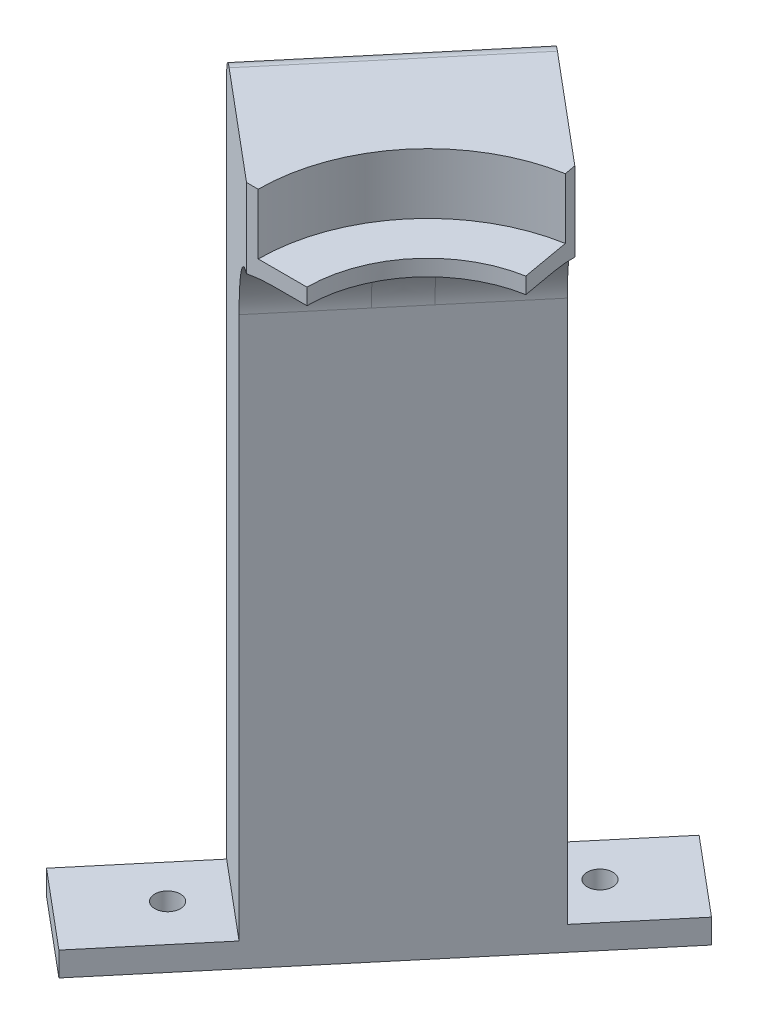
ISO-10303-21;
HEADER;
FILE_DESCRIPTION(('STEP AP214'),'2;1');
FILE_NAME('part.step','',(''),(''),'','','');
FILE_SCHEMA(('AUTOMOTIVE_DESIGN { 1 0 10303 214 1 1 1 1 }'));
ENDSEC;
DATA;
#1=APPLICATION_CONTEXT('core data for automotive mechanical design processes');
#2=APPLICATION_PROTOCOL_DEFINITION('international standard','automotive_design',2000,#1);
#3=PRODUCT_CONTEXT('',#1,'mechanical');
#4=PRODUCT('Part','Part','',(#3));
#5=PRODUCT_RELATED_PRODUCT_CATEGORY('part','',(#4));
#6=PRODUCT_DEFINITION_FORMATION('','',#4);
#7=PRODUCT_DEFINITION_CONTEXT('part definition',#1,'design');
#8=PRODUCT_DEFINITION('design','',#6,#7);
#9=PRODUCT_DEFINITION_SHAPE('','',#8);
#10=(LENGTH_UNIT() NAMED_UNIT(*) SI_UNIT(.MILLI.,.METRE.));
#11=(NAMED_UNIT(*) PLANE_ANGLE_UNIT() SI_UNIT($,.RADIAN.));
#12=(NAMED_UNIT(*) SI_UNIT($,.STERADIAN.) SOLID_ANGLE_UNIT());
#13=UNCERTAINTY_MEASURE_WITH_UNIT(LENGTH_MEASURE(1.E-05),#10,'distance_accuracy_value','');
#14=(GEOMETRIC_REPRESENTATION_CONTEXT(3) GLOBAL_UNCERTAINTY_ASSIGNED_CONTEXT((#13)) GLOBAL_UNIT_ASSIGNED_CONTEXT((#10,
#11,#12)) REPRESENTATION_CONTEXT('',''));
#15=CARTESIAN_POINT('',(0.,0.,0.));
#16=DIRECTION('',(0.,0.,1.));
#17=DIRECTION('',(1.,0.,0.));
#18=AXIS2_PLACEMENT_3D('',#15,#16,#17);
#19=CARTESIAN_POINT('',(34.9197212885323,0.,-41.6157032979967));
#20=DIRECTION('',(-0.642787609686541,0.,0.766044443118976));
#21=DIRECTION('',(0.766044443118976,0.,0.642787609686541));
#22=AXIS2_PLACEMENT_3D('',#19,#20,#21);
#23=PLANE('',#22);
#24=DIRECTION('',(-0.766044443118976,0.,-0.642787609686541));
#25=VECTOR('',#24,1.);
#26=CARTESIAN_POINT('',(-2.97802935575824,-154.65,-73.4156918860695));
#27=LINE('',#26,#25);
#28=CARTESIAN_POINT('',(-2.97802935575824,-154.65,-73.4156918860695));
#29=VERTEX_POINT('',#28);
#30=CARTESIAN_POINT('',(-22.1291404337327,-154.65,-89.4853821282331));
#31=VERTEX_POINT('',#30);
#32=EDGE_CURVE('E198',#29,#31,#27,.T.);
#33=ORIENTED_EDGE('',*,*,#32,.F.);
#34=DIRECTION('',(0.,-1.,0.));
#35=VECTOR('',#34,1.);
#36=CARTESIAN_POINT('',(-2.97802935575824,-103.5,-73.4156918860695));
#37=LINE('',#36,#35);
#38=CARTESIAN_POINT('',(-2.97802935575824,-160.65,-73.4156918860695));
#39=VERTEX_POINT('',#38);
#40=EDGE_CURVE('E250',#29,#39,#37,.T.);
#41=ORIENTED_EDGE('',*,*,#40,.T.);
#42=DIRECTION('',(0.766044443118976,0.,0.642787609686541));
#43=VECTOR('',#42,1.);
#44=CARTESIAN_POINT('',(-22.1291404337327,-160.65,-89.4853821282331));
#45=LINE('',#44,#43);
#46=CARTESIAN_POINT('',(-22.1291404337327,-160.65,-89.4853821282331));
#47=VERTEX_POINT('',#46);
#48=EDGE_CURVE('E236',#47,#39,#45,.T.);
#49=ORIENTED_EDGE('',*,*,#48,.F.);
#50=DIRECTION('',(0.,1.,0.));
#51=VECTOR('',#50,1.);
#52=CARTESIAN_POINT('',(-22.1291404337327,-103.5,-89.4853821282331));
#53=LINE('',#52,#51);
#54=EDGE_CURVE('E253',#47,#31,#53,.T.);
#55=ORIENTED_EDGE('',*,*,#54,.T.);
#56=EDGE_LOOP('',(#33,#41,#49,#55));
#57=FACE_BOUND('',#56,.T.);
#58=ADVANCED_FACE('F43',(#57),#23,.F.);
#59=CARTESIAN_POINT('',(-39.0014226100418,0.,46.4800855118022));
#60=DIRECTION('',(-0.642787609686541,0.,0.766044443118977));
#61=DIRECTION('',(0.766044443118977,0.,0.642787609686541));
#62=AXIS2_PLACEMENT_3D('',#59,#60,#61);
#63=PLANE('',#62);
#64=DIRECTION('',(0.,1.,0.));
#65=VECTOR('',#64,1.);
#66=CARTESIAN_POINT('',(-76.8991732543323,-103.5,14.6800969237294));
#67=LINE('',#66,#65);
#68=CARTESIAN_POINT('',(-76.8991732543323,-160.65,14.6800969237294));
#69=VERTEX_POINT('',#68);
#70=CARTESIAN_POINT('',(-76.8991732543323,-154.65,14.6800969237294));
#71=VERTEX_POINT('',#70);
#72=EDGE_CURVE('E247',#69,#71,#67,.T.);
#73=ORIENTED_EDGE('',*,*,#72,.T.);
#74=DIRECTION('',(0.766044443118977,0.,0.642787609686541));
#75=VECTOR('',#74,1.);
#76=CARTESIAN_POINT('',(-96.0502843323067,-154.65,-1.38959331843411));
#77=LINE('',#76,#75);
#78=CARTESIAN_POINT('',(-96.0502843323067,-154.65,-1.38959331843411));
#79=VERTEX_POINT('',#78);
#80=EDGE_CURVE('E192',#79,#71,#77,.T.);
#81=ORIENTED_EDGE('',*,*,#80,.F.);
#82=DIRECTION('',(0.,-1.,0.));
#83=VECTOR('',#82,1.);
#84=CARTESIAN_POINT('',(-96.0502843323067,-97.5,-1.38959331843411));
#85=LINE('',#84,#83);
#86=CARTESIAN_POINT('',(-96.0502843323067,-160.65,-1.38959331843411));
#87=VERTEX_POINT('',#86);
#88=EDGE_CURVE('E244',#79,#87,#85,.T.);
#89=ORIENTED_EDGE('',*,*,#88,.T.);
#90=DIRECTION('',(-0.766044443118977,0.,-0.642787609686541));
#91=VECTOR('',#90,1.);
#92=CARTESIAN_POINT('',(-76.8991732543323,-160.65,14.6800969237294));
#93=LINE('',#92,#91);
#94=EDGE_CURVE('E228',#69,#87,#93,.T.);
#95=ORIENTED_EDGE('',*,*,#94,.F.);
#96=EDGE_LOOP('',(#73,#81,#89,#95));
#97=FACE_BOUND('',#96,.T.);
#98=ADVANCED_FACE('F389',(#97),#63,.T.);
#99=CARTESIAN_POINT('',(-73.8894813564539,-78.1,-9.29198815349686));
#100=DIRECTION('',(0.,-1.,0.));
#101=DIRECTION('',(0.,0.,-1.));
#102=AXIS2_PLACEMENT_3D('',#99,#100,#101);
#103=CYLINDRICAL_SURFACE('',#102,3.175);
#104=CARTESIAN_POINT('',(-73.8894813564539,-160.65,-9.29198815349686));
#105=DIRECTION('',(0.,-1.,0.));
#106=DIRECTION('',(0.,0.,-1.));
#107=AXIS2_PLACEMENT_3D('',#104,#105,#106);
#108=CIRCLE('',#107,3.175);
#109=CARTESIAN_POINT('',(-73.8894813564539,-160.65,-12.4669881534969));
#110=VERTEX_POINT('',#109);
#111=EDGE_CURVE('E205',#110,#110,#108,.T.);
#112=ORIENTED_EDGE('',*,*,#111,.T.);
#113=EDGE_LOOP('',(#112));
#114=FACE_BOUND('',#113,.T.);
#115=CARTESIAN_POINT('',(-73.8894813564539,-154.65,-9.29198815349686));
#116=DIRECTION('',(0.,1.,0.));
#117=DIRECTION('',(0.,0.,1.));
#118=AXIS2_PLACEMENT_3D('',#115,#116,#117);
#119=CIRCLE('',#118,3.175);
#120=CARTESIAN_POINT('',(-73.8894813564539,-154.65,-6.11698815349686));
#121=VERTEX_POINT('',#120);
#122=EDGE_CURVE('E194',#121,#121,#119,.T.);
#123=ORIENTED_EDGE('',*,*,#122,.T.);
#124=EDGE_LOOP('',(#123));
#125=FACE_BOUND('',#124,.T.);
#126=ADVANCED_FACE('F395',(#114,#125),#103,.F.);
#127=CARTESIAN_POINT('',(-24.9090654983395,-78.1,-67.6645747191629));
#128=DIRECTION('',(0.,-1.,0.));
#129=DIRECTION('',(0.,0.,-1.));
#130=AXIS2_PLACEMENT_3D('',#127,#128,#129);
#131=CYLINDRICAL_SURFACE('',#130,3.175);
#132=CARTESIAN_POINT('',(-24.9090654983395,-160.65,-67.6645747191629));
#133=DIRECTION('',(0.,-1.,0.));
#134=DIRECTION('',(0.,0.,-1.));
#135=AXIS2_PLACEMENT_3D('',#132,#133,#134);
#136=CIRCLE('',#135,3.175);
#137=CARTESIAN_POINT('',(-24.9090654983395,-160.65,-70.8395747191629));
#138=VERTEX_POINT('',#137);
#139=EDGE_CURVE('E224',#138,#138,#136,.T.);
#140=ORIENTED_EDGE('',*,*,#139,.T.);
#141=EDGE_LOOP('',(#140));
#142=FACE_BOUND('',#141,.T.);
#143=CARTESIAN_POINT('',(-24.9090654983395,-154.65,-67.6645747191629));
#144=DIRECTION('',(0.,1.,0.));
#145=DIRECTION('',(0.,0.,1.));
#146=AXIS2_PLACEMENT_3D('',#143,#144,#145);
#147=CIRCLE('',#146,3.175);
#148=CARTESIAN_POINT('',(-24.9090654983395,-154.65,-64.4895747191629));
#149=VERTEX_POINT('',#148);
#150=EDGE_CURVE('E206',#149,#149,#147,.T.);
#151=ORIENTED_EDGE('',*,*,#150,.T.);
#152=EDGE_LOOP('',(#151));
#153=FACE_BOUND('',#152,.T.);
#154=ADVANCED_FACE('F560',(#142,#153),#131,.F.);
#155=CARTESIAN_POINT('',(0.,0.,0.));
#156=DIRECTION('',(0.,1.,0.));
#157=DIRECTION('',(0.,0.,1.));
#158=AXIS2_PLACEMENT_3D('',#155,#156,#157);
#159=PLANE('',#158);
#160=DIRECTION('',(-1.,0.,0.));
#161=VECTOR('',#160,1.);
#162=CARTESIAN_POINT('',(0.,0.,0.));
#163=LINE('',#162,#161);
#164=CARTESIAN_POINT('',(-30.,0.,0.));
#165=VERTEX_POINT('',#164);
#166=CARTESIAN_POINT('',(-38.4729635533386,0.,0.));
#167=VERTEX_POINT('',#166);
#168=EDGE_CURVE('E301',#165,#167,#163,.T.);
#169=ORIENTED_EDGE('',*,*,#168,.T.);
#170=DIRECTION('',(-0.642787609686541,0.,0.766044443118977));
#171=VECTOR('',#170,1.);
#172=CARTESIAN_POINT('',(-3.98394577941684,0.,-41.1024108371167));
#173=LINE('',#172,#171);
#174=CARTESIAN_POINT('',(-26.1788372794916,0.,-14.651569154664));
#175=VERTEX_POINT('',#174);
#176=EDGE_CURVE('E444',#167,#175,#173,.F.);
#177=ORIENTED_EDGE('',*,*,#176,.T.);
#178=CARTESIAN_POINT('',(0.,0.,0.));
#179=DIRECTION('',(0.,1.,0.));
#180=DIRECTION('',(0.,0.,1.));
#181=AXIS2_PLACEMENT_3D('',#178,#179,#180);
#182=CIRCLE('',#181,30.);
#183=EDGE_CURVE('E295',#175,#165,#182,.T.);
#184=ORIENTED_EDGE('',*,*,#183,.T.);
#185=EDGE_LOOP('',(#169,#177,#184));
#186=FACE_BOUND('',#185,.T.);
#187=ADVANCED_FACE('F469',(#186),#159,.F.);
#188=CARTESIAN_POINT('',(-5.20944533000783,0.,-29.5442325903663));
#189=VERTEX_POINT('',#188);
#190=CARTESIAN_POINT('',(-18.9748862843304,0.,-23.23690363402));
#191=VERTEX_POINT('',#190);
#192=EDGE_CURVE('E310',#189,#191,#182,.T.);
#193=ORIENTED_EDGE('',*,*,#192,.T.);
#194=DIRECTION('',(-0.642787609686541,0.,0.766044443118977));
#195=VECTOR('',#194,1.);
#196=CARTESIAN_POINT('',(-3.98394577941684,0.,-41.1024108371167));
#197=LINE('',#196,#195);
#198=CARTESIAN_POINT('',(-6.68076001048337,0.,-37.888472788684));
#199=VERTEX_POINT('',#198);
#200=EDGE_CURVE('E451',#191,#199,#197,.F.);
#201=ORIENTED_EDGE('',*,*,#200,.T.);
#202=DIRECTION('',(-0.173648177666928,0.,-0.984807753012209));
#203=VECTOR('',#202,1.);
#204=CARTESIAN_POINT('',(0.,0.,0.));
#205=LINE('',#204,#203);
#206=EDGE_CURVE('E314',#189,#199,#205,.T.);
#207=ORIENTED_EDGE('',*,*,#206,.F.);
#208=EDGE_LOOP('',(#193,#201,#207));
#209=FACE_BOUND('',#208,.T.);
#210=ADVANCED_FACE('F463',(#209),#159,.F.);
#211=CARTESIAN_POINT('',(0.,4.,0.));
#212=DIRECTION('',(0.,1.,0.));
#213=DIRECTION('',(0.,0.,1.));
#214=AXIS2_PLACEMENT_3D('',#211,#212,#213);
#215=PLANE('',#214);
#216=DIRECTION('',(-0.173648177666928,0.,-0.984807753012209));
#217=VECTOR('',#216,1.);
#218=CARTESIAN_POINT('',(0.,4.,0.));
#219=LINE('',#218,#217);
#220=CARTESIAN_POINT('',(-5.20944533000783,4.,-29.5442325903663));
#221=VERTEX_POINT('',#220);
#222=CARTESIAN_POINT('',(-7.31058827977765,4.,-41.460406401814));
#223=VERTEX_POINT('',#222);
#224=EDGE_CURVE('E300',#221,#223,#219,.T.);
#225=ORIENTED_EDGE('',*,*,#224,.T.);
#226=CARTESIAN_POINT('',(0.,4.,0.));
#227=DIRECTION('',(0.,1.,0.));
#228=DIRECTION('',(0.,0.,1.));
#229=AXIS2_PLACEMENT_3D('',#226,#227,#228);
#230=CIRCLE('',#229,42.1);
#231=CARTESIAN_POINT('',(-42.1,4.,0.));
#232=VERTEX_POINT('',#231);
#233=EDGE_CURVE('E292',#232,#223,#230,.F.);
#234=ORIENTED_EDGE('',*,*,#233,.F.);
#235=DIRECTION('',(-1.,0.,0.));
#236=VECTOR('',#235,1.);
#237=CARTESIAN_POINT('',(0.,4.,0.));
#238=LINE('',#237,#236);
#239=CARTESIAN_POINT('',(-30.,4.,0.));
#240=VERTEX_POINT('',#239);
#241=EDGE_CURVE('E305',#240,#232,#238,.T.);
#242=ORIENTED_EDGE('',*,*,#241,.F.);
#243=CARTESIAN_POINT('',(0.,4.,0.));
#244=DIRECTION('',(0.,1.,0.));
#245=DIRECTION('',(0.,0.,1.));
#246=AXIS2_PLACEMENT_3D('',#243,#244,#245);
#247=CIRCLE('',#246,30.);
#248=EDGE_CURVE('E296',#221,#240,#247,.T.);
#249=ORIENTED_EDGE('',*,*,#248,.F.);
#250=EDGE_LOOP('',(#225,#234,#242,#249));
#251=FACE_BOUND('',#250,.T.);
#252=ADVANCED_FACE('F479',(#251),#215,.T.);
#253=CARTESIAN_POINT('',(0.,4.,0.));
#254=DIRECTION('',(0.,-1.,0.));
#255=DIRECTION('',(0.,0.,-1.));
#256=AXIS2_PLACEMENT_3D('',#253,#254,#255);
#257=CYLINDRICAL_SURFACE('',#256,30.);
#258=ORIENTED_EDGE('',*,*,#192,.F.);
#259=DIRECTION('',(0.,-1.,0.));
#260=VECTOR('',#259,1.);
#261=CARTESIAN_POINT('',(-5.20944533000783,4.,-29.5442325903663));
#262=LINE('',#261,#260);
#263=EDGE_CURVE('E331',#221,#189,#262,.T.);
#264=ORIENTED_EDGE('',*,*,#263,.F.);
#265=ORIENTED_EDGE('',*,*,#248,.T.);
#266=DIRECTION('',(0.,-1.,0.));
#267=VECTOR('',#266,1.);
#268=CARTESIAN_POINT('',(-30.,4.,0.));
#269=LINE('',#268,#267);
#270=EDGE_CURVE('E309',#240,#165,#269,.T.);
#271=ORIENTED_EDGE('',*,*,#270,.T.);
#272=ORIENTED_EDGE('',*,*,#183,.F.);
#273=EDGE_CURVE('E315',#191,#175,#182,.T.);
#274=ORIENTED_EDGE('',*,*,#273,.F.);
#275=EDGE_LOOP('',(#258,#264,#265,#271,#272,#274));
#276=FACE_BOUND('',#275,.T.);
#277=ADVANCED_FACE('F354',(#276),#257,.F.);
#278=CARTESIAN_POINT('',(0.,4.,0.));
#279=DIRECTION('',(-0.984807753012209,0.,0.173648177666928));
#280=DIRECTION('',(0.173648177666928,0.,0.984807753012209));
#281=AXIS2_PLACEMENT_3D('',#278,#279,#280);
#282=PLANE('',#281);
#283=DIRECTION('',(0.,-1.,0.));
#284=VECTOR('',#283,1.);
#285=CARTESIAN_POINT('',(-7.31058827977765,14.,-41.460406401814));
#286=LINE('',#285,#284);
#287=CARTESIAN_POINT('',(-7.31058827977764,19.,-41.460406401814));
#288=VERTEX_POINT('',#287);
#289=EDGE_CURVE('E284',#288,#223,#286,.T.);
#290=ORIENTED_EDGE('',*,*,#289,.T.);
#291=ORIENTED_EDGE('',*,*,#224,.F.);
#292=ORIENTED_EDGE('',*,*,#263,.T.);
#293=ORIENTED_EDGE('',*,*,#206,.T.);
#294=CARTESIAN_POINT('',(-6.68076001048337,-20.,-37.888472788684));
#295=DIRECTION('',(-0.984807753012209,0.,0.173648177666928));
#296=DIRECTION('',(-0.173648177666928,0.,-0.984807753012209));
#297=AXIS2_PLACEMENT_3D('',#294,#295,#296);
#298=ELLIPSE('',#297,26.1081457866456,20.);
#299=CARTESIAN_POINT('',(-7.81416799501174,-0.635083268962916,-44.3163488855494));
#300=VERTEX_POINT('',#299);
#301=EDGE_CURVE('E424',#199,#300,#298,.T.);
#302=ORIENTED_EDGE('',*,*,#301,.T.);
#303=DIRECTION('',(0.,-1.,0.));
#304=VECTOR('',#303,1.);
#305=CARTESIAN_POINT('',(-7.81416799501174,4.,-44.3163488855494));
#306=LINE('',#305,#304);
#307=CARTESIAN_POINT('',(-7.81416799501175,19.,-44.3163488855494));
#308=VERTEX_POINT('',#307);
#309=EDGE_CURVE('E328',#308,#300,#306,.T.);
#310=ORIENTED_EDGE('',*,*,#309,.F.);
#311=DIRECTION('',(-0.173648177666927,0.,-0.984807753012209));
#312=VECTOR('',#311,1.);
#313=CARTESIAN_POINT('',(0.,19.,0.));
#314=LINE('',#313,#312);
#315=EDGE_CURVE('E268',#288,#308,#314,.T.);
#316=ORIENTED_EDGE('',*,*,#315,.F.);
#317=EDGE_LOOP('',(#290,#291,#292,#293,#302,#310,#316));
#318=FACE_BOUND('',#317,.T.);
#319=ADVANCED_FACE('F460',(#318),#282,.F.);
#320=CARTESIAN_POINT('',(0.,4.,0.));
#321=DIRECTION('',(0.,0.,1.));
#322=DIRECTION('',(1.,0.,0.));
#323=AXIS2_PLACEMENT_3D('',#320,#321,#322);
#324=PLANE('',#323);
#325=DIRECTION('',(0.,-1.,0.));
#326=VECTOR('',#325,1.);
#327=CARTESIAN_POINT('',(-45.,4.,0.));
#328=LINE('',#327,#326);
#329=CARTESIAN_POINT('',(-45.,19.,0.));
#330=VERTEX_POINT('',#329);
#331=CARTESIAN_POINT('',(-45.,-0.635083268962916,0.));
#332=VERTEX_POINT('',#331);
#333=EDGE_CURVE('E325',#330,#332,#328,.T.);
#334=ORIENTED_EDGE('',*,*,#333,.T.);
#335=CARTESIAN_POINT('',(-38.4729635533386,-20.,0.));
#336=DIRECTION('',(0.,0.,1.));
#337=DIRECTION('',(1.,0.,0.));
#338=AXIS2_PLACEMENT_3D('',#335,#336,#337);
#339=ELLIPSE('',#338,26.1081457866456,20.);
#340=EDGE_CURVE('E430',#332,#167,#339,.F.);
#341=ORIENTED_EDGE('',*,*,#340,.T.);
#342=ORIENTED_EDGE('',*,*,#168,.F.);
#343=ORIENTED_EDGE('',*,*,#270,.F.);
#344=ORIENTED_EDGE('',*,*,#241,.T.);
#345=DIRECTION('',(0.,-1.,0.));
#346=VECTOR('',#345,1.);
#347=CARTESIAN_POINT('',(-42.1,14.,0.));
#348=LINE('',#347,#346);
#349=CARTESIAN_POINT('',(-42.1,19.,0.));
#350=VERTEX_POINT('',#349);
#351=EDGE_CURVE('E288',#350,#232,#348,.T.);
#352=ORIENTED_EDGE('',*,*,#351,.F.);
#353=DIRECTION('',(1.,0.,0.));
#354=VECTOR('',#353,1.);
#355=CARTESIAN_POINT('',(0.,19.,0.));
#356=LINE('',#355,#354);
#357=EDGE_CURVE('E260',#330,#350,#356,.T.);
#358=ORIENTED_EDGE('',*,*,#357,.F.);
#359=EDGE_LOOP('',(#334,#341,#342,#343,#344,#352,#358));
#360=FACE_BOUND('',#359,.T.);
#361=ADVANCED_FACE('F474',(#360),#324,.T.);
#362=CARTESIAN_POINT('',(0.,14.,0.));
#363=DIRECTION('',(0.,-1.,0.));
#364=DIRECTION('',(0.,0.,-1.));
#365=AXIS2_PLACEMENT_3D('',#362,#363,#364);
#366=CYLINDRICAL_SURFACE('',#365,42.1);
#367=ORIENTED_EDGE('',*,*,#351,.T.);
#368=ORIENTED_EDGE('',*,*,#233,.T.);
#369=ORIENTED_EDGE('',*,*,#289,.F.);
#370=CARTESIAN_POINT('',(0.,19.,0.));
#371=DIRECTION('',(0.,1.,0.));
#372=DIRECTION('',(0.,0.,1.));
#373=AXIS2_PLACEMENT_3D('',#370,#371,#372);
#374=CIRCLE('',#373,42.1);
#375=EDGE_CURVE('E264',#288,#350,#374,.T.);
#376=ORIENTED_EDGE('',*,*,#375,.T.);
#377=EDGE_LOOP('',(#367,#368,#369,#376));
#378=FACE_BOUND('',#377,.T.);
#379=ADVANCED_FACE('F477',(#378),#366,.F.);
#380=CARTESIAN_POINT('',(-38.4559457197708,101.490947660166,-70.027853273011));
#381=DIRECTION('',(0.642787609686541,0.,-0.766044443118977));
#382=DIRECTION('',(-0.766044443118976,0.,-0.642787609686541));
#383=AXIS2_PLACEMENT_3D('',#380,#381,#382);
#384=PLANE('',#383);
#385=DIRECTION('',(0.,1.,0.));
#386=VECTOR('',#385,1.);
#387=CARTESIAN_POINT('',(-19.3048346417964,-103.5,-53.9581630308475));
#388=LINE('',#387,#386);
#389=CARTESIAN_POINT('',(-19.3048346417964,-154.65,-53.9581630308475));
#390=VERTEX_POINT('',#389);
#391=CARTESIAN_POINT('',(-19.3048346417964,-20.,-53.9581630308475));
#392=VERTEX_POINT('',#391);
#393=EDGE_CURVE('E182',#390,#392,#388,.T.);
#394=ORIENTED_EDGE('',*,*,#393,.F.);
#395=DIRECTION('',(0.766044443118977,0.,0.642787609686541));
#396=VECTOR('',#395,1.);
#397=CARTESIAN_POINT('',(-38.4559457197708,-154.65,-70.027853273011));
#398=LINE('',#397,#396);
#399=CARTESIAN_POINT('',(-38.4559457197708,-154.65,-70.027853273011));
#400=VERTEX_POINT('',#399);
#401=EDGE_CURVE('E214',#400,#390,#398,.T.);
#402=ORIENTED_EDGE('',*,*,#401,.F.);
#403=DIRECTION('',(0.,-1.,0.));
#404=VECTOR('',#403,1.);
#405=CARTESIAN_POINT('',(-38.4559457197708,101.490947660166,-70.027853273011));
#406=LINE('',#405,#404);
#407=CARTESIAN_POINT('',(-38.4559457197708,14.,-70.027853273011));
#408=VERTEX_POINT('',#407);
#409=EDGE_CURVE('E281',#408,#400,#406,.T.);
#410=ORIENTED_EDGE('',*,*,#409,.F.);
#411=CARTESIAN_POINT('',(-34.6257235041759,14.,-66.8139152245783));
#412=DIRECTION('',(0.642787609686541,0.,-0.766044443118977));
#413=DIRECTION('',(-0.766044443118976,0.,-0.642787609686541));
#414=AXIS2_PLACEMENT_3D('',#411,#412,#413);
#415=CIRCLE('',#414,5.);
#416=CARTESIAN_POINT('',(-34.6257235041759,19.,-66.8139152245783));
#417=VERTEX_POINT('',#416);
#418=EDGE_CURVE('E11',#408,#417,#415,.T.);
#419=ORIENTED_EDGE('',*,*,#418,.T.);
#420=DIRECTION('',(-0.766044443118977,0.,-0.642787609686541));
#421=VECTOR('',#420,1.);
#422=CARTESIAN_POINT('',(18.5929160024941,19.,-22.1581744427747));
#423=LINE('',#422,#421);
#424=EDGE_CURVE('E272',#308,#417,#423,.T.);
#425=ORIENTED_EDGE('',*,*,#424,.F.);
#426=ORIENTED_EDGE('',*,*,#309,.T.);
#427=CARTESIAN_POINT('',(-3.98394577941685,-20.,-41.1024108371167));
#428=DIRECTION('',(0.642787609686541,0.,-0.766044443118977));
#429=DIRECTION('',(-0.766044443118976,0.,-0.642787609686541));
#430=AXIS2_PLACEMENT_3D('',#427,#428,#429);
#431=CIRCLE('',#430,20.);
#432=EDGE_CURVE('E420',#300,#392,#431,.F.);
#433=ORIENTED_EDGE('',*,*,#432,.T.);
#434=EDGE_LOOP('',(#394,#402,#410,#419,#425,#426,#433));
#435=FACE_BOUND('',#434,.T.);
#436=ADVANCED_FACE('F507',(#435),#384,.T.);
#437=CARTESIAN_POINT('',(-45.,101.490947660166,0.));
#438=DIRECTION('',(-0.642787609686541,0.,0.766044443118977));
#439=DIRECTION('',(0.766044443118977,0.,0.642787609686541));
#440=AXIS2_PLACEMENT_3D('',#437,#438,#439);
#441=PLANE('',#440);
#442=DIRECTION('',(0.,-1.,0.));
#443=VECTOR('',#442,1.);
#444=CARTESIAN_POINT('',(-75.6417777247591,101.490947660166,-25.7115043874616));
#445=LINE('',#444,#443);
#446=CARTESIAN_POINT('',(-75.6417777247591,14.,-25.7115043874616));
#447=VERTEX_POINT('',#446);
#448=CARTESIAN_POINT('',(-75.6417777247591,-154.65,-25.7115043874616));
#449=VERTEX_POINT('',#448);
#450=EDGE_CURVE('E188',#447,#449,#445,.T.);
#451=ORIENTED_EDGE('',*,*,#450,.T.);
#452=DIRECTION('',(-0.766044443118977,0.,-0.64278760968654));
#453=VECTOR('',#452,1.);
#454=CARTESIAN_POINT('',(-56.4906666467847,-154.65,-9.64181414529812));
#455=LINE('',#454,#453);
#456=CARTESIAN_POINT('',(-56.4906666467847,-154.65,-9.64181414529812));
#457=VERTEX_POINT('',#456);
#458=EDGE_CURVE('E185',#457,#449,#455,.T.);
#459=ORIENTED_EDGE('',*,*,#458,.F.);
#460=DIRECTION('',(0.,1.,0.));
#461=VECTOR('',#460,1.);
#462=CARTESIAN_POINT('',(-56.4906666467847,-103.5,-9.64181414529812));
#463=LINE('',#462,#461);
#464=CARTESIAN_POINT('',(-56.4906666467847,-20.,-9.64181414529812));
#465=VERTEX_POINT('',#464);
#466=EDGE_CURVE('E170',#457,#465,#463,.T.);
#467=ORIENTED_EDGE('',*,*,#466,.T.);
#468=CARTESIAN_POINT('',(-41.1697777844051,-20.,3.21393804843269));
#469=DIRECTION('',(-0.642787609686541,0.,0.766044443118977));
#470=DIRECTION('',(0.766044443118977,0.,0.642787609686541));
#471=AXIS2_PLACEMENT_3D('',#468,#469,#470);
#472=CIRCLE('',#471,20.);
#473=EDGE_CURVE('E445',#465,#332,#472,.F.);
#474=ORIENTED_EDGE('',*,*,#473,.T.);
#475=ORIENTED_EDGE('',*,*,#333,.F.);
#476=DIRECTION('',(0.766044443118977,0.,0.642787609686541));
#477=VECTOR('',#476,1.);
#478=CARTESIAN_POINT('',(-18.5929160024941,19.,22.1581744427747));
#479=LINE('',#478,#477);
#480=CARTESIAN_POINT('',(-71.8115555091642,19.,-22.4975663390289));
#481=VERTEX_POINT('',#480);
#482=EDGE_CURVE('E257',#481,#330,#479,.T.);
#483=ORIENTED_EDGE('',*,*,#482,.F.);
#484=CARTESIAN_POINT('',(-71.8115555091642,14.,-22.4975663390289));
#485=DIRECTION('',(-0.642787609686541,0.,0.766044443118977));
#486=DIRECTION('',(0.766044443118977,0.,0.642787609686541));
#487=AXIS2_PLACEMENT_3D('',#484,#485,#486);
#488=CIRCLE('',#487,5.);
#489=EDGE_CURVE('E418',#481,#447,#488,.T.);
#490=ORIENTED_EDGE('',*,*,#489,.T.);
#491=EDGE_LOOP('',(#451,#459,#467,#474,#475,#483,#490));
#492=FACE_BOUND('',#491,.T.);
#493=ADVANCED_FACE('F186',(#492),#441,.T.);
#494=CARTESIAN_POINT('',(-75.6417777247591,101.490947660166,-25.7115043874616));
#495=DIRECTION('',(-0.766044443118977,0.,-0.642787609686541));
#496=DIRECTION('',(-0.642787609686541,0.,0.766044443118977));
#497=AXIS2_PLACEMENT_3D('',#494,#495,#496);
#498=PLANE('',#497);
#499=DIRECTION('',(-0.64278760968654,0.,0.766044443118977));
#500=VECTOR('',#499,1.);
#501=CARTESIAN_POINT('',(-75.6417777247591,-154.65,-25.7115043874616));
#502=LINE('',#501,#500);
#503=EDGE_CURVE('E67',#449,#79,#502,.T.);
#504=ORIENTED_EDGE('',*,*,#503,.F.);
#505=ORIENTED_EDGE('',*,*,#450,.F.);
#506=DIRECTION('',(-0.642787609686541,0.,0.766044443118977));
#507=VECTOR('',#506,1.);
#508=CARTESIAN_POINT('',(-75.6417777247591,14.,-25.7115043874616));
#509=LINE('',#508,#507);
#510=EDGE_CURVE('E52',#447,#408,#509,.F.);
#511=ORIENTED_EDGE('',*,*,#510,.T.);
#512=ORIENTED_EDGE('',*,*,#409,.T.);
#513=DIRECTION('',(-0.642787609686541,0.,0.766044443118977));
#514=VECTOR('',#513,1.);
#515=CARTESIAN_POINT('',(-22.1291404337327,-154.65,-89.4853821282331));
#516=LINE('',#515,#514);
#517=EDGE_CURVE('E210',#31,#400,#516,.T.);
#518=ORIENTED_EDGE('',*,*,#517,.F.);
#519=ORIENTED_EDGE('',*,*,#54,.F.);
#520=DIRECTION('',(0.642787609686541,0.,-0.766044443118977));
#521=VECTOR('',#520,1.);
#522=CARTESIAN_POINT('',(-96.0502843323067,-160.65,-1.38959331843411));
#523=LINE('',#522,#521);
#524=EDGE_CURVE('E232',#87,#47,#523,.T.);
#525=ORIENTED_EDGE('',*,*,#524,.F.);
#526=ORIENTED_EDGE('',*,*,#88,.F.);
#527=EDGE_LOOP('',(#504,#505,#511,#512,#518,#519,#525,#526));
#528=FACE_BOUND('',#527,.T.);
#529=ADVANCED_FACE('F387',(#528),#498,.T.);
#530=CARTESIAN_POINT('',(-19.3048346417964,-103.5,-53.9581630308475));
#531=DIRECTION('',(-0.766044443118977,0.,-0.642787609686541));
#532=DIRECTION('',(-0.642787609686541,0.,0.766044443118977));
#533=AXIS2_PLACEMENT_3D('',#530,#531,#532);
#534=PLANE('',#533);
#535=ORIENTED_EDGE('',*,*,#466,.F.);
#536=DIRECTION('',(0.64278760968654,0.,-0.766044443118977));
#537=VECTOR('',#536,1.);
#538=CARTESIAN_POINT('',(-76.8991732543323,-154.65,14.6800969237294));
#539=LINE('',#538,#537);
#540=EDGE_CURVE('E174',#71,#457,#539,.T.);
#541=ORIENTED_EDGE('',*,*,#540,.F.);
#542=ORIENTED_EDGE('',*,*,#72,.F.);
#543=DIRECTION('',(-0.642787609686541,0.,0.766044443118977));
#544=VECTOR('',#543,1.);
#545=CARTESIAN_POINT('',(-2.97802935575824,-160.65,-73.4156918860695));
#546=LINE('',#545,#544);
#547=EDGE_CURVE('E240',#39,#69,#546,.T.);
#548=ORIENTED_EDGE('',*,*,#547,.F.);
#549=ORIENTED_EDGE('',*,*,#40,.F.);
#550=DIRECTION('',(0.642787609686541,0.,-0.766044443118976));
#551=VECTOR('',#550,1.);
#552=CARTESIAN_POINT('',(-19.3048346417964,-154.65,-53.9581630308475));
#553=LINE('',#552,#551);
#554=EDGE_CURVE('E59',#390,#29,#553,.T.);
#555=ORIENTED_EDGE('',*,*,#554,.F.);
#556=ORIENTED_EDGE('',*,*,#393,.T.);
#557=DIRECTION('',(-0.642787609686541,0.,0.766044443118977));
#558=VECTOR('',#557,1.);
#559=CARTESIAN_POINT('',(-56.4906666467847,-20.,-9.64181414529812));
#560=LINE('',#559,#558);
#561=CARTESIAN_POINT('',(-34.2957751467099,-20.,-36.0926558277508));
#562=VERTEX_POINT('',#561);
#563=EDGE_CURVE('E345',#392,#562,#560,.T.);
#564=ORIENTED_EDGE('',*,*,#563,.T.);
#565=CARTESIAN_POINT('',(-22.1201176626565,-18.1713531483921,-50.6030393765679));
#566=CARTESIAN_POINT('',(-27.1816429716414,8.59026196425348,-44.5709484055788));
#567=CARTESIAN_POINT('',(-5.31816404289481,0.,-29.5248561590545));
#568=CARTESIAN_POINT('',(-22.3583721583751,-18.2804174886329,-50.3190987253436));
#569=CARTESIAN_POINT('',(-27.1779082997154,8.36205599485056,-44.5753992142637));
#570=CARTESIAN_POINT('',(-5.53739226825397,0.,-29.485361211326));
#571=CARTESIAN_POINT('',(-22.5978403334484,-18.382948720244,-50.033711667388));
#572=CARTESIAN_POINT('',(-27.1859370074351,8.13051466653967,-44.5658309729949));
#573=CARTESIAN_POINT('',(-5.76140056855477,0.,-29.4424968702709));
#574=CARTESIAN_POINT('',(-23.0787737969323,-18.5756758805618,-49.4605574844823));
#575=CARTESIAN_POINT('',(-27.2250945867015,7.66619639513612,-44.5191647872269));
#576=CARTESIAN_POINT('',(-6.21870438983476,0.,-29.3493145080877));
#577=CARTESIAN_POINT('',(-23.3202386992501,-18.6658741374747,-49.1727908196596));
#578=CARTESIAN_POINT('',(-27.2559820378996,7.43343484302143,-44.4823545562954));
#579=CARTESIAN_POINT('',(-6.45199814714894,0.,-29.2989978975379));
#580=CARTESIAN_POINT('',(-23.8045256396965,-18.8346023736619,-48.5956401185362));
#581=CARTESIAN_POINT('',(-27.3398979009698,6.96976584121419,-44.3823475250059));
#582=CARTESIAN_POINT('',(-6.92738842371758,0.,-29.1902491069292));
#583=CARTESIAN_POINT('',(-24.0473456264556,-18.9131466667865,-48.3062585269624));
#584=CARTESIAN_POINT('',(-27.3926767494487,6.73883493498265,-44.3194481427182));
#585=CARTESIAN_POINT('',(-7.16947368205209,0.,-29.1318270559332));
#586=CARTESIAN_POINT('',(-24.534324212234,-19.0594848484381,-47.7259000478446));
#587=CARTESIAN_POINT('',(-27.5192996649397,6.28097718552578,-44.168544828277));
#588=CARTESIAN_POINT('',(-7.66240814499419,0.,-29.0060717835355));
#589=CARTESIAN_POINT('',(-24.7784828774175,-19.1272782005521,-47.4349230814491));
#590=CARTESIAN_POINT('',(-27.5929422405914,6.05399193550964,-44.0807810241762));
#591=CARTESIAN_POINT('',(-7.91325778613482,0.,-28.9387381178003));
#592=CARTESIAN_POINT('',(-25.5096091462433,-19.3149735788109,-46.563600723936));
#593=CARTESIAN_POINT('',(-27.841650614773,5.38812860094689,-43.784381925737));
#594=CARTESIAN_POINT('',(-8.67536299532176,0.,-28.7230893225661));
#595=CARTESIAN_POINT('',(-25.9981497946065,-19.4201869413782,-45.9813806511208));
#596=CARTESIAN_POINT('',(-28.046351623178,4.95459958490828,-43.5404287635627));
#597=CARTESIAN_POINT('',(-9.19904586062257,0.,-28.5604892904236));
#598=CARTESIAN_POINT('',(-26.9777685103005,-19.5977189755409,-44.8139165273199));
#599=CARTESIAN_POINT('',(-28.525997014854,4.12549313533618,-42.9688096448615));
#600=CARTESIAN_POINT('',(-10.2757818465579,0.,-28.1909960269134));
#601=CARTESIAN_POINT('',(-27.4688473790248,-19.670026523301,-44.2286715212707));
#602=CARTESIAN_POINT('',(-28.7999230817767,3.72889433222137,-42.6423572705013));
#603=CARTESIAN_POINT('',(-10.8288448287105,0.,-27.9840878518533));
#604=CARTESIAN_POINT('',(-28.4504224828202,-19.7879785028121,-43.0588758649214));
#605=CARTESIAN_POINT('',(-29.4070293198712,2.98429557942283,-41.9188362301657));
#606=CARTESIAN_POINT('',(-11.9565148904508,0.,-27.5211136063783));
#607=CARTESIAN_POINT('',(-28.9409139273786,-19.8337224886213,-42.4743309237323));
#608=CARTESIAN_POINT('',(-29.7393528253987,2.63492797945882,-41.5227884985498));
#609=CARTESIAN_POINT('',(-12.5310328273035,0.,-27.2652359220256));
#610=CARTESIAN_POINT('',(-29.9224169145387,-19.9052488746737,-41.3046212126423));
#611=CARTESIAN_POINT('',(-30.4542819367092,1.98888479300367,-40.6707691616954));
#612=CARTESIAN_POINT('',(-13.6962610022056,0.,-26.6989101234998));
#613=CARTESIAN_POINT('',(-30.4134284063163,-19.9310330724782,-40.7194565033113));
#614=CARTESIAN_POINT('',(-30.8367121094744,1.69093214770653,-40.2150066293861));
#615=CARTESIAN_POINT('',(-14.2869697771598,0.,-26.3884669265407));
#616=CARTESIAN_POINT('',(-31.3964202404301,-19.9686235800211,-39.5479724535154));
#617=CARTESIAN_POINT('',(-31.6431090667288,1.15062073034296,-39.253980158521));
#618=CARTESIAN_POINT('',(-15.4765121944811,0.,-25.7088952080916));
#619=CARTESIAN_POINT('',(-31.8884008955399,-19.9804079294631,-38.9616527403014));
#620=CARTESIAN_POINT('',(-32.0674119550589,0.907117269084019,-38.7483156670056));
#621=CARTESIAN_POINT('',(-16.0753571151951,0.,-25.3396755151262));
#622=CARTESIAN_POINT('',(-32.872413088064,-19.9953296613726,-37.7889526747044));
#623=CARTESIAN_POINT('',(-32.9478625258584,0.477953984527925,-37.6990355361537));
#624=CARTESIAN_POINT('',(-17.2695309543001,0.,-24.5413673731021));
#625=CARTESIAN_POINT('',(-33.3644446262388,-19.9984668871157,-37.2025723214149));
#626=CARTESIAN_POINT('',(-33.4046825114991,0.291212995332335,-37.1546186770976));
#627=CARTESIAN_POINT('',(-17.8648598087694,0.,-24.1122778390842));
#628=CARTESIAN_POINT('',(-34.2697132956317,-20.0004475984072,-36.1237151324029));
#629=CARTESIAN_POINT('',(-34.266651507136,0.00114938063958573,-36.1273640298425));
#630=CARTESIAN_POINT('',(-18.9459742522142,0.,-23.2689068330678));
#631=CARTESIAN_POINT('',(-34.6829505357361,-19.9998982285618,-35.6312381669148));
#632=CARTESIAN_POINT('',(-34.6685699536873,-0.111151218437536,-35.6483762772351));
#633=CARTESIAN_POINT('',(-19.4340350322065,0.,-22.8632578709916));
#634=CARTESIAN_POINT('',(-35.5094188716984,-19.9979495706271,-34.6462915583664));
#635=CARTESIAN_POINT('',(-35.483288235665,-0.294703255352241,-34.6774328377359));
#636=CARTESIAN_POINT('',(-20.3919770577791,0.,-22.0131140970348));
#637=CARTESIAN_POINT('',(-35.9226499675692,-19.9965502930206,-34.1538219152907));
#638=CARTESIAN_POINT('',(-35.8968311810072,-0.366323504746776,-34.1845915469323));
#639=CARTESIAN_POINT('',(-20.8618585275071,0.,-21.5686197643313));
#640=CARTESIAN_POINT('',(-36.7488505870581,-19.9942899631295,-33.1691943588112));
#641=CARTESIAN_POINT('',(-36.7293127006738,-0.468619303374033,-33.1924787051014));
#642=CARTESIAN_POINT('',(-21.7761498161096,0.,-20.6451249725338));
#643=CARTESIAN_POINT('',(-37.1618201102023,-19.9934285697438,-32.6770364459723));
#644=CARTESIAN_POINT('',(-37.1490819291312,-0.499531725464146,-32.6922172190269));
#645=CARTESIAN_POINT('',(-22.2205756150176,0.,-20.1661465970163));
#646=CARTESIAN_POINT('',(-37.9877610644857,-19.9928550713676,-31.6927183464343));
#647=CARTESIAN_POINT('',(-37.9890876637623,-0.520675185480638,-31.6911373669805));
#648=CARTESIAN_POINT('',(-23.0780168663434,0.,-19.1789613480316));
#649=CARTESIAN_POINT('',(-38.4007324956265,-19.9931429705126,-31.2005581597335));
#650=CARTESIAN_POINT('',(-38.4102002967006,-0.510950224796032,-31.1892748737894));
#651=CARTESIAN_POINT('',(-23.4910322057329,0.,-18.670754369399));
#652=CARTESIAN_POINT('',(-39.2275907835633,-19.9946762289799,-30.2151468245186));
#653=CARTESIAN_POINT('',(-39.2486873828666,-0.450915502889909,-30.1900048765072));
#654=CARTESIAN_POINT('',(-24.2814294880327,0.,-17.6306492665631));
#655=CARTESIAN_POINT('',(-39.6414776383612,-19.9959237113555,-29.7218956783856));
#656=CARTESIAN_POINT('',(-39.6669178297047,-0.40039036771233,-29.6915772389556));
#657=CARTESIAN_POINT('',(-24.6587303319792,0.,-17.0987010770824));
#658=CARTESIAN_POINT('',(-40.4692492846541,-19.998381692173,-28.7353958450684));
#659=CARTESIAN_POINT('',(-40.4935815864609,-0.258801863624541,-28.706397736974));
#660=CARTESIAN_POINT('',(-25.3730206501881,0.,-16.0196306088213));
#661=CARTESIAN_POINT('',(-40.8831340761496,-19.9995921907885,-28.2421471578836));
#662=CARTESIAN_POINT('',(-40.9028163750993,-0.167448792003286,-28.2186907073997));
#663=CARTESIAN_POINT('',(-25.7100103138901,0.,-15.472508401365));
#664=CARTESIAN_POINT('',(-41.7111775225136,-20.0002438459076,-27.2553234058551));
#665=CARTESIAN_POINT('',(-41.7067095070421,0.0556609010332192,-27.2606481793451));
#666=CARTESIAN_POINT('',(-26.3418816586232,0.,-14.3704227938792));
#667=CARTESIAN_POINT('',(-42.1253361789136,-19.9996838411133,-26.7617483391865));
#668=CARTESIAN_POINT('',(-42.1020431359521,0.187884591252727,-26.7895079068183));
#669=CARTESIAN_POINT('',(-26.6367355696741,0.,-13.815454485118));
#670=CARTESIAN_POINT('',(-42.7465711184086,-19.9957256052319,-26.0213893681983));
#671=CARTESIAN_POINT('',(-42.6790733918219,0.415780336988693,-26.1018300263499));
#672=CARTESIAN_POINT('',(-27.0469667766305,0.,-12.9829682140055));
#673=CARTESIAN_POINT('',(-42.9536509352797,-19.993886455484,-25.7746012524883));
#674=CARTESIAN_POINT('',(-42.8693965364072,0.496991275342828,-25.8750117350365));
#675=CARTESIAN_POINT('',(-27.1783700229393,0.,-12.7054644602528));
#676=CARTESIAN_POINT('',(-43.3678051435667,-19.9888109588732,-25.2810314868744));
#677=CARTESIAN_POINT('',(-43.2445335589575,0.669388945372811,-25.4279408406971));
#678=CARTESIAN_POINT('',(-27.4306118961551,0.,-12.1513071274048));
#679=CARTESIAN_POINT('',(-43.5748795349189,-19.9855745997616,-25.034249837046));
#680=CARTESIAN_POINT('',(-43.4294022904374,0.760653669927473,-25.2076228657976));
#681=CARTESIAN_POINT('',(-27.5514504304343,0.,-11.8746535557842));
#682=CARTESIAN_POINT('',(-43.7819478632823,-19.9814607695308,-24.7874754128066));
#683=CARTESIAN_POINT('',(-43.6107556016499,0.856651068318858,-24.9914944056313));
#684=CARTESIAN_POINT('',(-27.6670654087696,0.,-11.5988573431552));
#685=(BOUNDED_SURFACE() B_SPLINE_SURFACE(3,2,((#565,#566,#567),(#568,#569,#570),(#571,#572,
#573),(#574,#575,#576),(#577,#578,#579),(#580,#581,#582),(#583,#584,#585),(#586,#587,#588),
(#589,#590,#591),(#592,#593,#594),(#595,#596,#597),(#598,#599,#600),(#601,#602,#603),(#604,#605,
#606),(#607,#608,#609),(#610,#611,#612),(#613,#614,#615),(#616,#617,#618),(#619,#620,#621),
(#622,#623,#624),(#625,#626,#627),(#628,#629,#630),(#631,#632,#633),(#634,#635,#636),(#637,#638,
#639),(#640,#641,#642),(#643,#644,#645),(#646,#647,#648),(#649,#650,#651),(#652,#653,#654),
(#655,#656,#657),(#658,#659,#660),(#661,#662,#663),(#664,#665,#666),(#667,#668,#669),(#670,#671,
#672),(#673,#674,#675),(#676,#677,#678),(#679,#680,#681),(#682,#683,#684)),.UNSPECIFIED.,.F.,
.F.,.F.) B_SPLINE_SURFACE_WITH_KNOTS((4,2,2,2,2,2,2,2,2,2,2,2,2,2,2,2,2,2,2,4),(3,3),(0.,
1.15900496979374,2.31779084084118,3.47514145007799,4.63254978660212,6.93342042447087,
9.23506829664933,11.5280335092143,13.820792195255,16.1171425957547,18.4135346160411,
20.342183368026,22.2708083325148,24.1982090075766,26.1256166179279,28.0573008775217,
29.988976058935,31.9219185157212,32.8884085181382,33.8549069935638),(0.,1.),
.UNSPECIFIED.) GEOMETRIC_REPRESENTATION_ITEM() RATIONAL_B_SPLINE_SURFACE(((1.,0.582669756146618,
1.),(1.,0.585728062296957,1.),(1.,0.588794089933594,1.),(1.,0.594927601513215,1.),(1.,
0.59799508507133,1.),(1.,0.604114895930754,1.),(1.,0.607167237298616,1.),(1.,0.613246663825505,
1.),(1.,0.616273747717188,1.),(1.,0.625259652976264,1.),(1.,0.631160311735478,1.),(1.,
0.642686917308824,1.),(1.,0.648312770651919,1.),(1.,0.659139983653469,1.),(1.,0.664342864597619,
1.),(1.,0.674215263776489,1.),(1.,0.678884830008781,1.),(1.,0.687564747762214,1.),(1.,
0.691574055133022,1.),(1.,0.698796087278483,1.),(1.,0.7020087976143,1.),(1.,0.707082705877871,
1.),(1.,0.709077945492251,1.),(1.,0.71237327141843,1.),(1.,0.713673366303781,1.),(1.,
0.715541130398321,1.),(1.,0.716109264026784,1.),(1.,0.716498202441375,1.),(1.,0.716319004538411,
1.),(1.,0.715217257749016,1.),(1.,0.714293060352461,1.),(1.,0.711725842044775,1.),(1.,
0.710082824511862,1.),(1.,0.706122124061978,1.),(1.,0.703803999237985,1.),(1.,0.699866741224956,
1.),(1.,0.698477627698559,1.),(1.,0.695554869342928,1.),(1.,0.694021223246726,1.),(1.,
0.692419734701163,1.))) REPRESENTATION_ITEM('') SURFACE());
#686=CARTESIAN_POINT('',(-22.1201176626565,-18.1713531483921,-50.6030393765679));
#687=CARTESIAN_POINT('',(-22.3583721583751,-18.2804174886329,-50.3190987253436));
#688=CARTESIAN_POINT('',(-22.5978403334484,-18.382948720244,-50.033711667388));
#689=CARTESIAN_POINT('',(-23.0787737969323,-18.5756758805618,-49.4605574844823));
#690=CARTESIAN_POINT('',(-23.3202386992501,-18.6658741374747,-49.1727908196596));
#691=CARTESIAN_POINT('',(-23.8045256396965,-18.8346023736619,-48.5956401185362));
#692=CARTESIAN_POINT('',(-24.0473456264556,-18.9131466667865,-48.3062585269624));
#693=CARTESIAN_POINT('',(-24.534324212234,-19.0594848484381,-47.7259000478446));
#694=CARTESIAN_POINT('',(-24.7784828774175,-19.1272782005521,-47.4349230814491));
#695=CARTESIAN_POINT('',(-25.5096091462433,-19.3149735788109,-46.563600723936));
#696=CARTESIAN_POINT('',(-25.9981497946065,-19.4201869413782,-45.9813806511208));
#697=CARTESIAN_POINT('',(-26.9777685103005,-19.5977189755409,-44.8139165273199));
#698=CARTESIAN_POINT('',(-27.4688473790248,-19.670026523301,-44.2286715212707));
#699=CARTESIAN_POINT('',(-28.4504224828202,-19.7879785028121,-43.0588758649214));
#700=CARTESIAN_POINT('',(-28.9409139273786,-19.8337224886213,-42.4743309237323));
#701=CARTESIAN_POINT('',(-29.9224169145387,-19.9052488746737,-41.3046212126423));
#702=CARTESIAN_POINT('',(-30.4134284063163,-19.9310330724782,-40.7194565033113));
#703=CARTESIAN_POINT('',(-31.3964202404301,-19.9686235800211,-39.5479724535154));
#704=CARTESIAN_POINT('',(-31.8884008955399,-19.9804079294631,-38.9616527403014));
#705=CARTESIAN_POINT('',(-32.872413088064,-19.9953296613726,-37.7889526747044));
#706=CARTESIAN_POINT('',(-33.3644446262388,-19.9984668871157,-37.2025723214149));
#707=CARTESIAN_POINT('',(-34.2697132956317,-20.0004475984072,-36.1237151324029));
#708=CARTESIAN_POINT('',(-34.6829505357361,-19.9998982285618,-35.6312381669148));
#709=CARTESIAN_POINT('',(-35.5094188716984,-19.9979495706271,-34.6462915583664));
#710=CARTESIAN_POINT('',(-35.9226499675692,-19.9965502930206,-34.1538219152907));
#711=CARTESIAN_POINT('',(-36.7488505870581,-19.9942899631295,-33.1691943588113));
#712=CARTESIAN_POINT('',(-37.1618201102023,-19.9934285697438,-32.6770364459723));
#713=CARTESIAN_POINT('',(-37.9877610644857,-19.9928550713676,-31.6927183464343));
#714=CARTESIAN_POINT('',(-38.4007324956265,-19.9931429705126,-31.2005581597335));
#715=CARTESIAN_POINT('',(-39.2275907835633,-19.9946762289799,-30.2151468245186));
#716=CARTESIAN_POINT('',(-39.6414776383612,-19.9959237113555,-29.7218956783856));
#717=CARTESIAN_POINT('',(-40.4692492846541,-19.998381692173,-28.7353958450684));
#718=CARTESIAN_POINT('',(-40.8831340761496,-19.9995921907885,-28.2421471578836));
#719=CARTESIAN_POINT('',(-41.7111775225136,-20.0002438459076,-27.2553234058551));
#720=CARTESIAN_POINT('',(-42.1253361789136,-19.9996838411133,-26.7617483391865));
#721=CARTESIAN_POINT('',(-42.7465711184086,-19.9957256052319,-26.0213893681983));
#722=CARTESIAN_POINT('',(-42.9536509352797,-19.993886455484,-25.7746012524883));
#723=CARTESIAN_POINT('',(-43.3678051435667,-19.9888109588732,-25.2810314868744));
#724=CARTESIAN_POINT('',(-43.5748795349189,-19.9855745997616,-25.034249837046));
#725=CARTESIAN_POINT('',(-43.7819478632823,-19.9814607695308,-24.7874754128066));
#726=B_SPLINE_CURVE_WITH_KNOTS('',3,(#686,#687,#688,#689,#690,#691,#692,#693,#694,#695,#696,
#697,#698,#699,#700,#701,#702,#703,#704,#705,#706,#707,#708,#709,#710,#711,#712,#713,#714,#715,
#716,#717,#718,#719,#720,#721,#722,#723,#724,#725),.UNSPECIFIED.,.F.,.F.,(4,2,2,2,2,2,2,2,2,2,2,
2,2,2,2,2,2,2,2,4),(0.,1.15900496979374,2.31779084084118,3.47514145007799,4.63254978660212,
6.93342042447087,9.23506829664933,11.5280335092143,13.820792195255,16.1171425957547,
18.4135346160411,20.342183368026,22.2708083325148,24.1982090075766,26.1256166179279,
28.0573008775217,29.988976058935,31.9219185157212,32.8884085181382,33.8549069935638),.UNSPECIFIED.);
#727=CARTESIAN_POINT('',(-41.4997261418711,-20.,-27.5073213483948));
#728=VERTEX_POINT('',#727);
#729=EDGE_CURVE('E336',#562,#728,#726,.T.);
#730=ORIENTED_EDGE('',*,*,#729,.T.);
#731=DIRECTION('',(-0.642787609686541,0.,0.766044443118977));
#732=VECTOR('',#731,1.);
#733=CARTESIAN_POINT('',(-56.4906666467847,-20.,-9.64181414529812));
#734=LINE('',#733,#732);
#735=EDGE_CURVE('E177',#728,#465,#734,.T.);
#736=ORIENTED_EDGE('',*,*,#735,.T.);
#737=EDGE_LOOP('',(#535,#541,#542,#548,#549,#555,#556,#564,#730,#736));
#738=FACE_BOUND('',#737,.T.);
#739=ADVANCED_FACE('F172',(#738),#534,.F.);
#740=CARTESIAN_POINT('',(-3.98394577941684,-20.,-41.1024108371167));
#741=DIRECTION('',(0.642787609686541,0.,-0.766044443118977));
#742=DIRECTION('',(-0.766044443118977,0.,-0.642787609686541));
#743=AXIS2_PLACEMENT_3D('',#740,#741,#742);
#744=CYLINDRICAL_SURFACE('',#743,20.);
#745=ORIENTED_EDGE('',*,*,#473,.F.);
#746=ORIENTED_EDGE('',*,*,#735,.F.);
#747=CARTESIAN_POINT('',(-26.1788372794916,-20.,-14.651569154664));
#748=DIRECTION('',(-0.642787609686541,0.,0.766044443118977));
#749=DIRECTION('',(0.766044443118977,0.,0.642787609686541));
#750=AXIS2_PLACEMENT_3D('',#747,#748,#749);
#751=CIRCLE('',#750,20.);
#752=EDGE_CURVE('E183',#175,#728,#751,.T.);
#753=ORIENTED_EDGE('',*,*,#752,.F.);
#754=ORIENTED_EDGE('',*,*,#176,.F.);
#755=ORIENTED_EDGE('',*,*,#340,.F.);
#756=EDGE_LOOP('',(#745,#746,#753,#754,#755));
#757=FACE_BOUND('',#756,.T.);
#758=ADVANCED_FACE('F363',(#757),#744,.F.);
#759=ORIENTED_EDGE('',*,*,#752,.T.);
#760=ORIENTED_EDGE('',*,*,#729,.F.);
#761=CARTESIAN_POINT('',(-18.9748862843304,-20.,-23.23690363402));
#762=DIRECTION('',(0.642787609686541,0.,-0.766044443118977));
#763=DIRECTION('',(-0.766044443118977,0.,-0.642787609686541));
#764=AXIS2_PLACEMENT_3D('',#761,#762,#763);
#765=CIRCLE('',#764,20.);
#766=EDGE_CURVE('E275',#191,#562,#765,.F.);
#767=ORIENTED_EDGE('',*,*,#766,.F.);
#768=ORIENTED_EDGE('',*,*,#273,.T.);
#769=EDGE_LOOP('',(#759,#760,#767,#768));
#770=FACE_BOUND('',#769,.T.);
#771=ADVANCED_FACE('F358',(#770),#685,.F.);
#772=CARTESIAN_POINT('',(-3.98394577941684,-20.,-41.1024108371167));
#773=DIRECTION('',(0.642787609686541,0.,-0.766044443118977));
#774=DIRECTION('',(-0.766044443118977,0.,-0.642787609686541));
#775=AXIS2_PLACEMENT_3D('',#772,#773,#774);
#776=CYLINDRICAL_SURFACE('',#775,20.);
#777=ORIENTED_EDGE('',*,*,#301,.F.);
#778=ORIENTED_EDGE('',*,*,#200,.F.);
#779=ORIENTED_EDGE('',*,*,#766,.T.);
#780=ORIENTED_EDGE('',*,*,#563,.F.);
#781=ORIENTED_EDGE('',*,*,#432,.F.);
#782=EDGE_LOOP('',(#777,#778,#779,#780,#781));
#783=FACE_BOUND('',#782,.T.);
#784=ADVANCED_FACE('F357',(#783),#776,.F.);
#785=CARTESIAN_POINT('',(0.,19.,0.));
#786=DIRECTION('',(0.,1.,0.));
#787=DIRECTION('',(0.,0.,1.));
#788=AXIS2_PLACEMENT_3D('',#785,#786,#787);
#789=PLANE('',#788);
#790=ORIENTED_EDGE('',*,*,#424,.T.);
#791=DIRECTION('',(-0.642787609686541,0.,0.766044443118977));
#792=VECTOR('',#791,1.);
#793=CARTESIAN_POINT('',(-53.2186395066701,19.,-44.6557407818036));
#794=LINE('',#793,#792);
#795=EDGE_CURVE('E378',#417,#481,#794,.T.);
#796=ORIENTED_EDGE('',*,*,#795,.T.);
#797=ORIENTED_EDGE('',*,*,#482,.T.);
#798=ORIENTED_EDGE('',*,*,#357,.T.);
#799=ORIENTED_EDGE('',*,*,#375,.F.);
#800=ORIENTED_EDGE('',*,*,#315,.T.);
#801=EDGE_LOOP('',(#790,#796,#797,#798,#799,#800));
#802=FACE_BOUND('',#801,.T.);
#803=ADVANCED_FACE('F399',(#802),#789,.T.);
#804=CARTESIAN_POINT('',(-53.2186395066701,14.,-44.6557407818036));
#805=DIRECTION('',(-0.642787609686541,0.,0.766044443118977));
#806=DIRECTION('',(0.766044443118977,0.,0.642787609686541));
#807=AXIS2_PLACEMENT_3D('',#804,#805,#806);
#808=CYLINDRICAL_SURFACE('',#807,5.);
#809=ORIENTED_EDGE('',*,*,#418,.F.);
#810=ORIENTED_EDGE('',*,*,#510,.F.);
#811=ORIENTED_EDGE('',*,*,#489,.F.);
#812=ORIENTED_EDGE('',*,*,#795,.F.);
#813=EDGE_LOOP('',(#809,#810,#811,#812));
#814=FACE_BOUND('',#813,.T.);
#815=ADVANCED_FACE('F45',(#814),#808,.T.);
#816=CARTESIAN_POINT('',(0.,-160.65,0.));
#817=DIRECTION('',(0.,-1.,0.));
#818=DIRECTION('',(0.,0.,-1.));
#819=AXIS2_PLACEMENT_3D('',#816,#817,#818);
#820=PLANE('',#819);
#821=ORIENTED_EDGE('',*,*,#139,.F.);
#822=EDGE_LOOP('',(#821));
#823=FACE_BOUND('',#822,.T.);
#824=ORIENTED_EDGE('',*,*,#94,.T.);
#825=ORIENTED_EDGE('',*,*,#524,.T.);
#826=ORIENTED_EDGE('',*,*,#48,.T.);
#827=ORIENTED_EDGE('',*,*,#547,.T.);
#828=EDGE_LOOP('',(#824,#825,#826,#827));
#829=FACE_BOUND('',#828,.T.);
#830=ORIENTED_EDGE('',*,*,#111,.F.);
#831=EDGE_LOOP('',(#830));
#832=FACE_BOUND('',#831,.T.);
#833=ADVANCED_FACE('F406',(#823,#829,#832),#820,.T.);
#834=CARTESIAN_POINT('',(0.,-154.65,0.));
#835=DIRECTION('',(0.,1.,0.));
#836=DIRECTION('',(0.,0.,1.));
#837=AXIS2_PLACEMENT_3D('',#834,#835,#836);
#838=PLANE('',#837);
#839=ORIENTED_EDGE('',*,*,#150,.F.);
#840=EDGE_LOOP('',(#839));
#841=FACE_BOUND('',#840,.T.);
#842=ORIENTED_EDGE('',*,*,#517,.T.);
#843=ORIENTED_EDGE('',*,*,#401,.T.);
#844=ORIENTED_EDGE('',*,*,#554,.T.);
#845=ORIENTED_EDGE('',*,*,#32,.T.);
#846=EDGE_LOOP('',(#842,#843,#844,#845));
#847=FACE_BOUND('',#846,.T.);
#848=ADVANCED_FACE('F536',(#841,#847),#838,.T.);
#849=CARTESIAN_POINT('',(0.,-154.65,0.));
#850=DIRECTION('',(0.,1.,0.));
#851=DIRECTION('',(0.,0.,1.));
#852=AXIS2_PLACEMENT_3D('',#849,#850,#851);
#853=PLANE('',#852);
#854=ORIENTED_EDGE('',*,*,#122,.F.);
#855=EDGE_LOOP('',(#854));
#856=FACE_BOUND('',#855,.T.);
#857=ORIENTED_EDGE('',*,*,#540,.T.);
#858=ORIENTED_EDGE('',*,*,#458,.T.);
#859=ORIENTED_EDGE('',*,*,#503,.T.);
#860=ORIENTED_EDGE('',*,*,#80,.T.);
#861=EDGE_LOOP('',(#857,#858,#859,#860));
#862=FACE_BOUND('',#861,.T.);
#863=ADVANCED_FACE('F191',(#856,#862),#853,.T.);
#864=CLOSED_SHELL('',(#58,#98,#126,#154,#187,#210,#252,#277,#319,#361,#379,#436,#493,#529,#739,
#758,#771,#784,#803,#815,#833,#848,#863));
#865=MANIFOLD_SOLID_BREP('B2',#864);
#866=ADVANCED_BREP_SHAPE_REPRESENTATION('',(#18,#865),#14);
#867=SHAPE_DEFINITION_REPRESENTATION(#9,#866);
ENDSEC;
END-ISO-10303-21;
